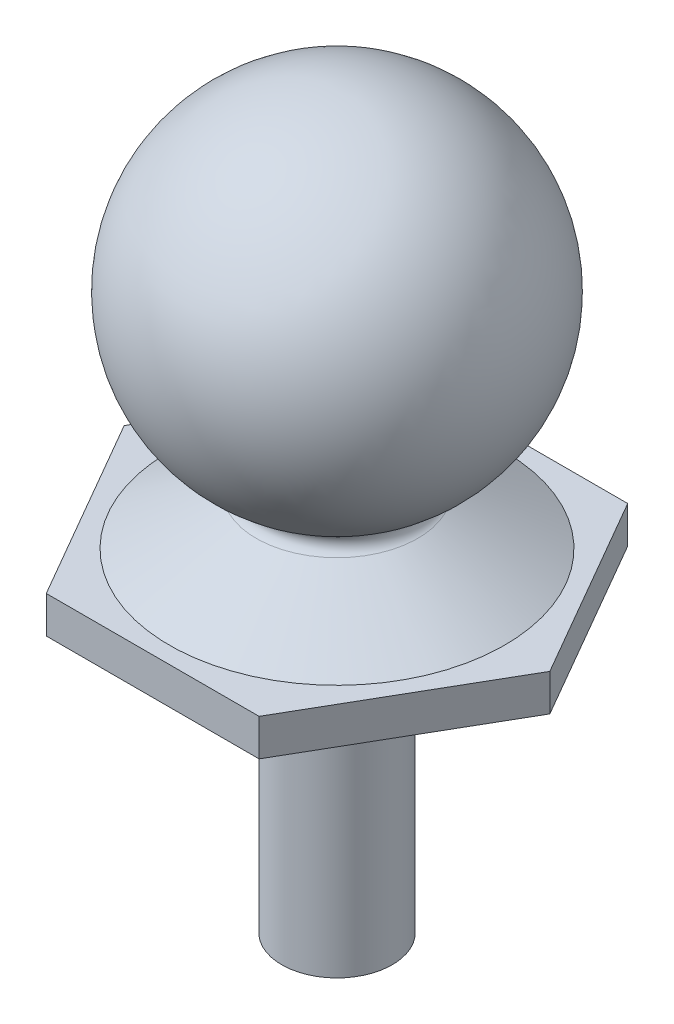
ISO-10303-21;
HEADER;
FILE_DESCRIPTION(('STEP AP214'),'2;1');
FILE_NAME('part.step','',(''),(''),'','','');
FILE_SCHEMA(('AUTOMOTIVE_DESIGN { 1 0 10303 214 1 1 1 1 }'));
ENDSEC;
DATA;
#1=APPLICATION_CONTEXT('core data for automotive mechanical design processes');
#2=APPLICATION_PROTOCOL_DEFINITION('international standard','automotive_design',2000,#1);
#3=PRODUCT_CONTEXT('',#1,'mechanical');
#4=PRODUCT('Part','Part','',(#3));
#5=PRODUCT_RELATED_PRODUCT_CATEGORY('part','',(#4));
#6=PRODUCT_DEFINITION_FORMATION('','',#4);
#7=PRODUCT_DEFINITION_CONTEXT('part definition',#1,'design');
#8=PRODUCT_DEFINITION('design','',#6,#7);
#9=PRODUCT_DEFINITION_SHAPE('','',#8);
#10=(LENGTH_UNIT() NAMED_UNIT(*) SI_UNIT(.MILLI.,.METRE.));
#11=(NAMED_UNIT(*) PLANE_ANGLE_UNIT() SI_UNIT($,.RADIAN.));
#12=(NAMED_UNIT(*) SI_UNIT($,.STERADIAN.) SOLID_ANGLE_UNIT());
#13=UNCERTAINTY_MEASURE_WITH_UNIT(LENGTH_MEASURE(1.E-05),#10,'distance_accuracy_value','');
#14=(GEOMETRIC_REPRESENTATION_CONTEXT(3) GLOBAL_UNCERTAINTY_ASSIGNED_CONTEXT((#13)) GLOBAL_UNIT_ASSIGNED_CONTEXT((#10,
#11,#12)) REPRESENTATION_CONTEXT('',''));
#15=CARTESIAN_POINT('',(0.,0.,0.));
#16=DIRECTION('',(0.,0.,1.));
#17=DIRECTION('',(1.,0.,0.));
#18=AXIS2_PLACEMENT_3D('',#15,#16,#17);
#19=CARTESIAN_POINT('',(0.,-15.0679446006876,0.));
#20=DIRECTION('',(0.,1.,0.));
#21=DIRECTION('',(-1.,0.,0.));
#22=AXIS2_PLACEMENT_3D('',#19,#20,#21);
#23=PLANE('',#22);
#24=CARTESIAN_POINT('',(0.,-15.0679446006876,0.));
#25=DIRECTION('',(0.,1.,0.));
#26=DIRECTION('',(-1.,0.,0.));
#27=AXIS2_PLACEMENT_3D('',#24,#25,#26);
#28=CIRCLE('',#27,1.5);
#29=CARTESIAN_POINT('',(-1.5,-15.0679446006876,0.));
#30=VERTEX_POINT('',#29);
#31=EDGE_CURVE('E151',#30,#30,#28,.T.);
#32=ORIENTED_EDGE('',*,*,#31,.F.);
#33=EDGE_LOOP('',(#32));
#34=FACE_BOUND('',#33,.T.);
#35=ADVANCED_FACE('F33',(#34),#23,.F.);
#36=CARTESIAN_POINT('',(0.,4.70962475823742,0.));
#37=DIRECTION('',(0.,1.,0.));
#38=DIRECTION('',(-1.,0.,0.));
#39=AXIS2_PLACEMENT_3D('',#36,#37,#38);
#40=CYLINDRICAL_SURFACE('',#39,1.5);
#41=CARTESIAN_POINT('',(0.,-7.03782556199581,0.));
#42=DIRECTION('',(0.,1.,0.));
#43=DIRECTION('',(-1.,0.,0.));
#44=AXIS2_PLACEMENT_3D('',#41,#42,#43);
#45=CIRCLE('',#44,1.5);
#46=CARTESIAN_POINT('',(-1.5,-7.03782556199581,0.));
#47=VERTEX_POINT('',#46);
#48=EDGE_CURVE('E148',#47,#47,#45,.T.);
#49=ORIENTED_EDGE('',*,*,#48,.F.);
#50=EDGE_LOOP('',(#49));
#51=FACE_BOUND('',#50,.T.);
#52=ORIENTED_EDGE('',*,*,#31,.T.);
#53=EDGE_LOOP('',(#52));
#54=FACE_BOUND('',#53,.T.);
#55=ADVANCED_FACE('F177',(#51,#54),#40,.T.);
#56=CARTESIAN_POINT('',(1.5,-7.03782556199581,0.));
#57=DIRECTION('',(0.,1.,0.));
#58=DIRECTION('',(-1.,0.,0.));
#59=AXIS2_PLACEMENT_3D('',#56,#57,#58);
#60=PLANE('',#59);
#61=DIRECTION('',(0.5,0.,-0.866025403784438));
#62=VECTOR('',#61,1.);
#63=CARTESIAN_POINT('',(-5.77350269189626,-7.03782556199581,0.));
#64=LINE('',#63,#62);
#65=CARTESIAN_POINT('',(-5.77350269189626,-7.03782556199581,0.));
#66=VERTEX_POINT('',#65);
#67=CARTESIAN_POINT('',(-2.88675134594813,-7.03782556199581,-5.00000000000001));
#68=VERTEX_POINT('',#67);
#69=EDGE_CURVE('E101',#66,#68,#64,.T.);
#70=ORIENTED_EDGE('',*,*,#69,.T.);
#71=DIRECTION('',(1.,0.,0.));
#72=VECTOR('',#71,1.);
#73=CARTESIAN_POINT('',(-2.88675134594813,-7.03782556199581,-5.00000000000001));
#74=LINE('',#73,#72);
#75=CARTESIAN_POINT('',(2.88675134594813,-7.03782556199581,-5.00000000000001));
#76=VERTEX_POINT('',#75);
#77=EDGE_CURVE('E72',#68,#76,#74,.T.);
#78=ORIENTED_EDGE('',*,*,#77,.T.);
#79=DIRECTION('',(0.5,0.,0.866025403784439));
#80=VECTOR('',#79,1.);
#81=CARTESIAN_POINT('',(2.88675134594813,-7.03782556199581,-5.00000000000001));
#82=LINE('',#81,#80);
#83=CARTESIAN_POINT('',(5.77350269189626,-7.03782556199581,0.));
#84=VERTEX_POINT('',#83);
#85=EDGE_CURVE('E127',#76,#84,#82,.T.);
#86=ORIENTED_EDGE('',*,*,#85,.T.);
#87=DIRECTION('',(-0.5,0.,0.866025403784439));
#88=VECTOR('',#87,1.);
#89=CARTESIAN_POINT('',(5.77350269189626,-7.03782556199581,0.));
#90=LINE('',#89,#88);
#91=CARTESIAN_POINT('',(2.88675134594813,-7.03782556199581,5.00000000000001));
#92=VERTEX_POINT('',#91);
#93=EDGE_CURVE('E129',#84,#92,#90,.T.);
#94=ORIENTED_EDGE('',*,*,#93,.T.);
#95=DIRECTION('',(-1.,0.,0.));
#96=VECTOR('',#95,1.);
#97=CARTESIAN_POINT('',(2.88675134594813,-7.03782556199581,5.00000000000001));
#98=LINE('',#97,#96);
#99=CARTESIAN_POINT('',(-2.88675134594813,-7.03782556199581,5.00000000000001));
#100=VERTEX_POINT('',#99);
#101=EDGE_CURVE('E131',#92,#100,#98,.T.);
#102=ORIENTED_EDGE('',*,*,#101,.T.);
#103=DIRECTION('',(-0.5,0.,-0.866025403784439));
#104=VECTOR('',#103,1.);
#105=CARTESIAN_POINT('',(-2.88675134594813,-7.03782556199581,5.00000000000001));
#106=LINE('',#105,#104);
#107=EDGE_CURVE('E133',#100,#66,#106,.T.);
#108=ORIENTED_EDGE('',*,*,#107,.T.);
#109=EDGE_LOOP('',(#70,#78,#86,#94,#102,#108));
#110=FACE_BOUND('',#109,.T.);
#111=ORIENTED_EDGE('',*,*,#48,.T.);
#112=EDGE_LOOP('',(#111));
#113=FACE_BOUND('',#112,.T.);
#114=ADVANCED_FACE('F169',(#110,#113),#60,.F.);
#115=CARTESIAN_POINT('',(0.,-6.03782556199581,0.));
#116=DIRECTION('',(0.,-1.,0.));
#117=DIRECTION('',(0.,0.,-1.));
#118=AXIS2_PLACEMENT_3D('',#115,#116,#117);
#119=PLANE('',#118);
#120=DIRECTION('',(0.5,0.,0.866025403784439));
#121=VECTOR('',#120,1.);
#122=CARTESIAN_POINT('',(2.88675134594813,-6.03782556199581,-5.00000000000001));
#123=LINE('',#122,#121);
#124=CARTESIAN_POINT('',(2.88675134594813,-6.03782556199581,-5.00000000000001));
#125=VERTEX_POINT('',#124);
#126=CARTESIAN_POINT('',(5.77350269189626,-6.03782556199581,0.));
#127=VERTEX_POINT('',#126);
#128=EDGE_CURVE('E137',#125,#127,#123,.T.);
#129=ORIENTED_EDGE('',*,*,#128,.F.);
#130=DIRECTION('',(1.,0.,0.));
#131=VECTOR('',#130,1.);
#132=CARTESIAN_POINT('',(-2.88675134594813,-6.03782556199581,-5.00000000000001));
#133=LINE('',#132,#131);
#134=CARTESIAN_POINT('',(-2.88675134594813,-6.03782556199581,-5.00000000000001));
#135=VERTEX_POINT('',#134);
#136=EDGE_CURVE('E116',#135,#125,#133,.T.);
#137=ORIENTED_EDGE('',*,*,#136,.F.);
#138=DIRECTION('',(0.5,0.,-0.866025403784438));
#139=VECTOR('',#138,1.);
#140=CARTESIAN_POINT('',(-5.77350269189626,-6.03782556199581,0.));
#141=LINE('',#140,#139);
#142=CARTESIAN_POINT('',(-5.77350269189626,-6.03782556199581,0.));
#143=VERTEX_POINT('',#142);
#144=EDGE_CURVE('E99',#143,#135,#141,.T.);
#145=ORIENTED_EDGE('',*,*,#144,.F.);
#146=DIRECTION('',(-0.5,0.,-0.866025403784439));
#147=VECTOR('',#146,1.);
#148=CARTESIAN_POINT('',(-2.88675134594813,-6.03782556199581,5.00000000000001));
#149=LINE('',#148,#147);
#150=CARTESIAN_POINT('',(-2.88675134594813,-6.03782556199581,5.00000000000001));
#151=VERTEX_POINT('',#150);
#152=EDGE_CURVE('E113',#151,#143,#149,.T.);
#153=ORIENTED_EDGE('',*,*,#152,.F.);
#154=DIRECTION('',(-1.,0.,0.));
#155=VECTOR('',#154,1.);
#156=CARTESIAN_POINT('',(2.88675134594813,-6.03782556199581,5.00000000000001));
#157=LINE('',#156,#155);
#158=CARTESIAN_POINT('',(2.88675134594813,-6.03782556199581,5.00000000000001));
#159=VERTEX_POINT('',#158);
#160=EDGE_CURVE('E120',#159,#151,#157,.T.);
#161=ORIENTED_EDGE('',*,*,#160,.F.);
#162=DIRECTION('',(-0.5,0.,0.866025403784439));
#163=VECTOR('',#162,1.);
#164=CARTESIAN_POINT('',(5.77350269189626,-6.03782556199581,0.));
#165=LINE('',#164,#163);
#166=EDGE_CURVE('E122',#127,#159,#165,.T.);
#167=ORIENTED_EDGE('',*,*,#166,.F.);
#168=EDGE_LOOP('',(#129,#137,#145,#153,#161,#167));
#169=FACE_BOUND('',#168,.T.);
#170=CARTESIAN_POINT('',(0.,-6.03782556199581,0.));
#171=DIRECTION('',(0.,-1.,0.));
#172=DIRECTION('',(0.,0.,-1.));
#173=AXIS2_PLACEMENT_3D('',#170,#171,#172);
#174=CIRCLE('',#173,4.54644968257653);
#175=CARTESIAN_POINT('',(0.,-6.03782556199581,-4.54644968257653));
#176=VERTEX_POINT('',#175);
#177=EDGE_CURVE('E11',#176,#176,#174,.T.);
#178=ORIENTED_EDGE('',*,*,#177,.T.);
#179=EDGE_LOOP('',(#178));
#180=FACE_BOUND('',#179,.T.);
#181=ADVANCED_FACE('F110',(#169,#180),#119,.F.);
#182=CARTESIAN_POINT('',(2.88675134594813,-6.03782556199581,-5.00000000000001));
#183=DIRECTION('',(0.866025403784439,0.,-0.5));
#184=DIRECTION('',(-0.5,0.,-0.866025403784439));
#185=AXIS2_PLACEMENT_3D('',#182,#183,#184);
#186=PLANE('',#185);
#187=ORIENTED_EDGE('',*,*,#85,.F.);
#188=DIRECTION('',(0.,-1.,0.));
#189=VECTOR('',#188,1.);
#190=CARTESIAN_POINT('',(2.88675134594813,-6.03782556199581,-5.00000000000001));
#191=LINE('',#190,#189);
#192=EDGE_CURVE('E50',#125,#76,#191,.T.);
#193=ORIENTED_EDGE('',*,*,#192,.F.);
#194=ORIENTED_EDGE('',*,*,#128,.T.);
#195=DIRECTION('',(0.,-1.,0.));
#196=VECTOR('',#195,1.);
#197=CARTESIAN_POINT('',(5.77350269189626,-6.03782556199581,0.));
#198=LINE('',#197,#196);
#199=EDGE_CURVE('E83',#127,#84,#198,.T.);
#200=ORIENTED_EDGE('',*,*,#199,.T.);
#201=EDGE_LOOP('',(#187,#193,#194,#200));
#202=FACE_BOUND('',#201,.T.);
#203=ADVANCED_FACE('F168',(#202),#186,.T.);
#204=CARTESIAN_POINT('',(-2.88675134594813,-6.03782556199581,-5.00000000000001));
#205=DIRECTION('',(0.,0.,-1.));
#206=DIRECTION('',(-1.,0.,0.));
#207=AXIS2_PLACEMENT_3D('',#204,#205,#206);
#208=PLANE('',#207);
#209=ORIENTED_EDGE('',*,*,#77,.F.);
#210=DIRECTION('',(0.,-1.,0.));
#211=VECTOR('',#210,1.);
#212=CARTESIAN_POINT('',(-2.88675134594813,-6.03782556199581,-5.00000000000001));
#213=LINE('',#212,#211);
#214=EDGE_CURVE('E105',#135,#68,#213,.T.);
#215=ORIENTED_EDGE('',*,*,#214,.F.);
#216=ORIENTED_EDGE('',*,*,#136,.T.);
#217=ORIENTED_EDGE('',*,*,#192,.T.);
#218=EDGE_LOOP('',(#209,#215,#216,#217));
#219=FACE_BOUND('',#218,.T.);
#220=ADVANCED_FACE('F175',(#219),#208,.T.);
#221=CARTESIAN_POINT('',(-5.77350269189626,-6.03782556199581,0.));
#222=DIRECTION('',(-0.866025403784439,0.,-0.5));
#223=DIRECTION('',(-0.5,0.,0.866025403784439));
#224=AXIS2_PLACEMENT_3D('',#221,#222,#223);
#225=PLANE('',#224);
#226=ORIENTED_EDGE('',*,*,#69,.F.);
#227=DIRECTION('',(0.,-1.,0.));
#228=VECTOR('',#227,1.);
#229=CARTESIAN_POINT('',(-5.77350269189626,-6.03782556199581,0.));
#230=LINE('',#229,#228);
#231=EDGE_CURVE('E95',#143,#66,#230,.T.);
#232=ORIENTED_EDGE('',*,*,#231,.F.);
#233=ORIENTED_EDGE('',*,*,#144,.T.);
#234=ORIENTED_EDGE('',*,*,#214,.T.);
#235=EDGE_LOOP('',(#226,#232,#233,#234));
#236=FACE_BOUND('',#235,.T.);
#237=ADVANCED_FACE('F97',(#236),#225,.T.);
#238=CARTESIAN_POINT('',(-2.88675134594813,-6.03782556199581,5.00000000000001));
#239=DIRECTION('',(-0.866025403784439,0.,0.5));
#240=DIRECTION('',(0.5,0.,0.866025403784439));
#241=AXIS2_PLACEMENT_3D('',#238,#239,#240);
#242=PLANE('',#241);
#243=ORIENTED_EDGE('',*,*,#107,.F.);
#244=DIRECTION('',(0.,-1.,0.));
#245=VECTOR('',#244,1.);
#246=CARTESIAN_POINT('',(-2.88675134594813,-6.03782556199581,5.00000000000001));
#247=LINE('',#246,#245);
#248=EDGE_CURVE('E106',#151,#100,#247,.T.);
#249=ORIENTED_EDGE('',*,*,#248,.F.);
#250=ORIENTED_EDGE('',*,*,#152,.T.);
#251=ORIENTED_EDGE('',*,*,#231,.T.);
#252=EDGE_LOOP('',(#243,#249,#250,#251));
#253=FACE_BOUND('',#252,.T.);
#254=ADVANCED_FACE('F118',(#253),#242,.T.);
#255=CARTESIAN_POINT('',(2.88675134594813,-6.03782556199581,5.00000000000001));
#256=DIRECTION('',(0.,0.,1.));
#257=DIRECTION('',(1.,0.,0.));
#258=AXIS2_PLACEMENT_3D('',#255,#256,#257);
#259=PLANE('',#258);
#260=ORIENTED_EDGE('',*,*,#101,.F.);
#261=DIRECTION('',(0.,-1.,0.));
#262=VECTOR('',#261,1.);
#263=CARTESIAN_POINT('',(2.88675134594813,-6.03782556199581,5.00000000000001));
#264=LINE('',#263,#262);
#265=EDGE_CURVE('E142',#159,#92,#264,.T.);
#266=ORIENTED_EDGE('',*,*,#265,.F.);
#267=ORIENTED_EDGE('',*,*,#160,.T.);
#268=ORIENTED_EDGE('',*,*,#248,.T.);
#269=EDGE_LOOP('',(#260,#266,#267,#268));
#270=FACE_BOUND('',#269,.T.);
#271=ADVANCED_FACE('F194',(#270),#259,.T.);
#272=CARTESIAN_POINT('',(5.77350269189626,-6.03782556199581,0.));
#273=DIRECTION('',(0.866025403784439,0.,0.5));
#274=DIRECTION('',(0.5,0.,-0.866025403784439));
#275=AXIS2_PLACEMENT_3D('',#272,#273,#274);
#276=PLANE('',#275);
#277=ORIENTED_EDGE('',*,*,#93,.F.);
#278=ORIENTED_EDGE('',*,*,#199,.F.);
#279=ORIENTED_EDGE('',*,*,#166,.T.);
#280=ORIENTED_EDGE('',*,*,#265,.T.);
#281=EDGE_LOOP('',(#277,#278,#279,#280));
#282=FACE_BOUND('',#281,.T.);
#283=ADVANCED_FACE('F190',(#282),#276,.T.);
#284=CARTESIAN_POINT('',(0.,0.,0.));
#285=DIRECTION('',(0.,1.,0.));
#286=DIRECTION('',(1.,0.,0.));
#287=AXIS2_PLACEMENT_3D('',#284,#285,#286);
#288=SPHERICAL_SURFACE('',#287,4.70962475823742);
#289=CARTESIAN_POINT('',(0.,-4.16215962154028,0.));
#290=DIRECTION('',(0.,1.,0.));
#291=DIRECTION('',(-1.,0.,0.));
#292=AXIS2_PLACEMENT_3D('',#289,#290,#291);
#293=CIRCLE('',#292,2.20385858172039);
#294=CARTESIAN_POINT('',(-2.20385858172039,-4.16215962154028,0.));
#295=VERTEX_POINT('',#294);
#296=EDGE_CURVE('E42',#295,#295,#293,.T.);
#297=ORIENTED_EDGE('',*,*,#296,.T.);
#298=EDGE_LOOP('',(#297));
#299=FACE_BOUND('',#298,.T.);
#300=ADVANCED_FACE('F156',(#299),#288,.T.);
#301=CARTESIAN_POINT('',(0.,-4.43691260265966,0.));
#302=DIRECTION('',(0.,1.,0.));
#303=DIRECTION('',(-1.,0.,0.));
#304=AXIS2_PLACEMENT_3D('',#301,#302,#303);
#305=TOROIDAL_SURFACE('',#304,2.3440048857197,0.308431819303157);
#306=ORIENTED_EDGE('',*,*,#296,.F.);
#307=EDGE_LOOP('',(#306));
#308=FACE_BOUND('',#307,.T.);
#309=CARTESIAN_POINT('',(0.,-4.70533574780486,0.));
#310=DIRECTION('',(0.,1.,0.));
#311=DIRECTION('',(-1.,0.,0.));
#312=AXIS2_PLACEMENT_3D('',#309,#310,#311);
#313=CIRCLE('',#312,2.19208647897118);
#314=CARTESIAN_POINT('',(-2.19208647897118,-4.70533574780486,0.));
#315=VERTEX_POINT('',#314);
#316=EDGE_CURVE('E139',#315,#315,#313,.T.);
#317=ORIENTED_EDGE('',*,*,#316,.T.);
#318=EDGE_LOOP('',(#317));
#319=FACE_BOUND('',#318,.T.);
#320=ADVANCED_FACE('F35',(#308,#319),#305,.F.);
#321=CARTESIAN_POINT('',(0.,-6.20962475824633,0.));
#322=DIRECTION('',(0.,-1.,0.));
#323=DIRECTION('',(1.,0.,0.));
#324=AXIS2_PLACEMENT_3D('',#321,#322,#323);
#325=CONICAL_SURFACE('',#324,4.85,1.05577774730954);
#326=ORIENTED_EDGE('',*,*,#316,.F.);
#327=EDGE_LOOP('',(#326));
#328=FACE_BOUND('',#327,.T.);
#329=ORIENTED_EDGE('',*,*,#177,.F.);
#330=EDGE_LOOP('',(#329));
#331=FACE_BOUND('',#330,.T.);
#332=ADVANCED_FACE('F160',(#328,#331),#325,.T.);
#333=CLOSED_SHELL('',(#35,#55,#114,#181,#203,#220,#237,#254,#271,#283,#300,#320,#332));
#334=MANIFOLD_SOLID_BREP('B2',#333);
#335=ADVANCED_BREP_SHAPE_REPRESENTATION('',(#18,#334),#14);
#336=SHAPE_DEFINITION_REPRESENTATION(#9,#335);
ENDSEC;
END-ISO-10303-21;
